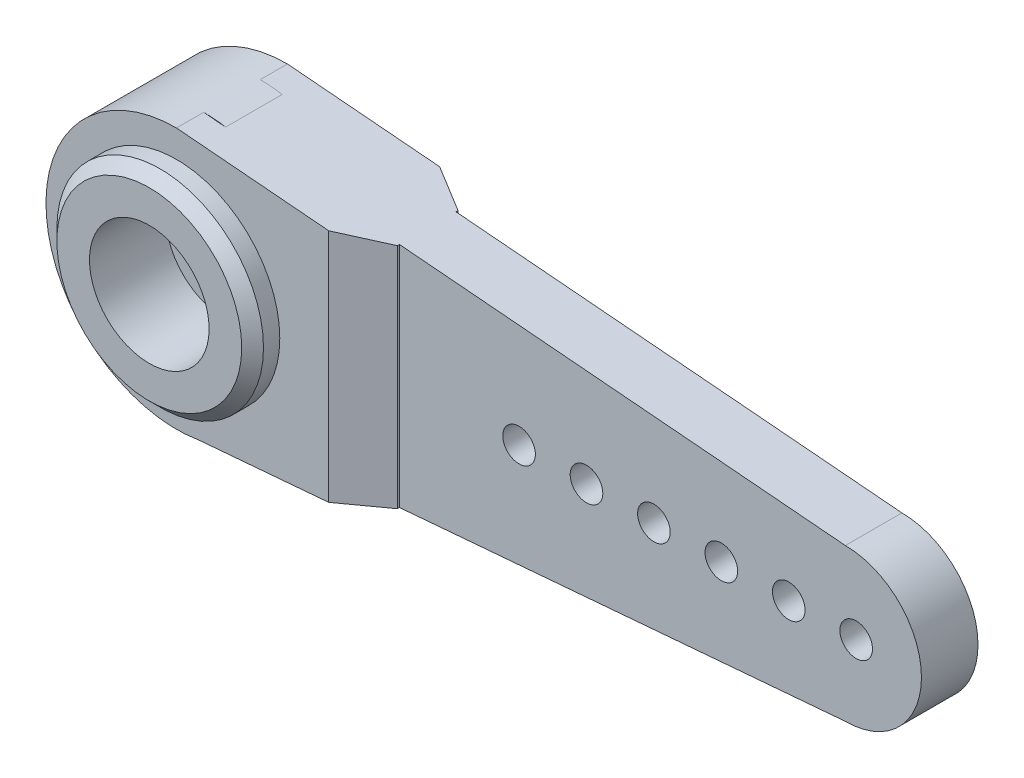
ISO-10303-21;
HEADER;
FILE_DESCRIPTION(('STEP AP214'),'2;1');
FILE_NAME('part.step','',(''),(''),'','','');
FILE_SCHEMA(('AUTOMOTIVE_DESIGN { 1 0 10303 214 1 1 1 1 }'));
ENDSEC;
DATA;
#1=APPLICATION_CONTEXT('core data for automotive mechanical design processes');
#2=APPLICATION_PROTOCOL_DEFINITION('international standard','automotive_design',2000,#1);
#3=PRODUCT_CONTEXT('',#1,'mechanical');
#4=PRODUCT('Part','Part','',(#3));
#5=PRODUCT_RELATED_PRODUCT_CATEGORY('part','',(#4));
#6=PRODUCT_DEFINITION_FORMATION('','',#4);
#7=PRODUCT_DEFINITION_CONTEXT('part definition',#1,'design');
#8=PRODUCT_DEFINITION('design','',#6,#7);
#9=PRODUCT_DEFINITION_SHAPE('','',#8);
#10=(LENGTH_UNIT() NAMED_UNIT(*) SI_UNIT(.MILLI.,.METRE.));
#11=(NAMED_UNIT(*) PLANE_ANGLE_UNIT() SI_UNIT($,.RADIAN.));
#12=(NAMED_UNIT(*) SI_UNIT($,.STERADIAN.) SOLID_ANGLE_UNIT());
#13=UNCERTAINTY_MEASURE_WITH_UNIT(LENGTH_MEASURE(1.E-05),#10,'distance_accuracy_value','');
#14=(GEOMETRIC_REPRESENTATION_CONTEXT(3) GLOBAL_UNCERTAINTY_ASSIGNED_CONTEXT((#13)) GLOBAL_UNIT_ASSIGNED_CONTEXT((#10,
#11,#12)) REPRESENTATION_CONTEXT('',''));
#15=CARTESIAN_POINT('',(0.,0.,0.));
#16=DIRECTION('',(0.,0.,1.));
#17=DIRECTION('',(1.,0.,0.));
#18=AXIS2_PLACEMENT_3D('',#15,#16,#17);
#19=CARTESIAN_POINT('',(9.,0.,-1.25));
#20=DIRECTION('',(1.,0.,0.));
#21=DIRECTION('',(0.,1.,0.));
#22=AXIS2_PLACEMENT_3D('',#19,#20,#21);
#23=PLANE('',#22);
#24=DIRECTION('',(0.,0.,-1.));
#25=VECTOR('',#24,1.);
#26=CARTESIAN_POINT('',(9.,-2.5,-1.25));
#27=LINE('',#26,#25);
#28=CARTESIAN_POINT('',(9.,-2.5,0.));
#29=VERTEX_POINT('',#28);
#30=CARTESIAN_POINT('',(9.,-2.5,-0.0952994616207431));
#31=VERTEX_POINT('',#30);
#32=EDGE_CURVE('E197',#29,#31,#27,.T.);
#33=ORIENTED_EDGE('',*,*,#32,.F.);
#34=DIRECTION('',(0.,1.,0.));
#35=VECTOR('',#34,1.);
#36=CARTESIAN_POINT('',(9.,0.,0.));
#37=LINE('',#36,#35);
#38=CARTESIAN_POINT('',(9.,-5.23728813559322,0.));
#39=VERTEX_POINT('',#38);
#40=EDGE_CURVE('E203',#39,#29,#37,.T.);
#41=ORIENTED_EDGE('',*,*,#40,.F.);
#42=DIRECTION('',(0.,0.,1.));
#43=VECTOR('',#42,1.);
#44=CARTESIAN_POINT('',(9.,-5.23728813559322,-1.25));
#45=LINE('',#44,#43);
#46=CARTESIAN_POINT('',(9.,-5.23728813559322,-0.0952994616207441));
#47=VERTEX_POINT('',#46);
#48=EDGE_CURVE('E221',#47,#39,#45,.T.);
#49=ORIENTED_EDGE('',*,*,#48,.F.);
#50=DIRECTION('',(0.,1.,0.));
#51=VECTOR('',#50,1.);
#52=CARTESIAN_POINT('',(9.,0.,-0.0952994616207441));
#53=LINE('',#52,#51);
#54=EDGE_CURVE('E326',#47,#31,#53,.T.);
#55=ORIENTED_EDGE('',*,*,#54,.T.);
#56=EDGE_LOOP('',(#33,#41,#49,#55));
#57=FACE_BOUND('',#56,.T.);
#58=ADVANCED_FACE('F35',(#57),#23,.T.);
#59=CARTESIAN_POINT('',(9.,0.,-0.0952994616207441));
#60=DIRECTION('',(-0.499999999999999,0.,0.86602540378444));
#61=DIRECTION('',(0.,1.,0.));
#62=AXIS2_PLACEMENT_3D('',#59,#60,#61);
#63=PLANE('',#62);
#64=DIRECTION('',(0.86602540378444,0.,0.499999999999999));
#65=VECTOR('',#64,1.);
#66=CARTESIAN_POINT('',(9.,-2.5,-0.0952994616207439));
#67=LINE('',#66,#65);
#68=CARTESIAN_POINT('',(6.99999999999998,-2.5,-1.25));
#69=VERTEX_POINT('',#68);
#70=EDGE_CURVE('E338',#31,#69,#67,.F.);
#71=ORIENTED_EDGE('',*,*,#70,.F.);
#72=ORIENTED_EDGE('',*,*,#54,.F.);
#73=DIRECTION('',(-0.863702411625004,-0.0731951196292377,-0.498658819851423));
#74=VECTOR('',#73,1.);
#75=CARTESIAN_POINT('',(9.33109507821987,-5.20922923065933,0.0958583709168599));
#76=LINE('',#75,#74);
#77=CARTESIAN_POINT('',(6.99999999999998,-5.40677966101695,-1.25));
#78=VERTEX_POINT('',#77);
#79=EDGE_CURVE('E334',#78,#47,#76,.F.);
#80=ORIENTED_EDGE('',*,*,#79,.F.);
#81=DIRECTION('',(0.,-1.,0.));
#82=VECTOR('',#81,1.);
#83=CARTESIAN_POINT('',(6.99999999999998,0.,-1.25));
#84=LINE('',#83,#82);
#85=EDGE_CURVE('E59',#69,#78,#84,.T.);
#86=ORIENTED_EDGE('',*,*,#85,.F.);
#87=EDGE_LOOP('',(#71,#72,#80,#86));
#88=FACE_BOUND('',#87,.T.);
#89=ADVANCED_FACE('F361',(#88),#63,.F.);
#90=CARTESIAN_POINT('',(0.,0.,0.));
#91=DIRECTION('',(0.,0.,1.));
#92=DIRECTION('',(1.,0.,0.));
#93=AXIS2_PLACEMENT_3D('',#90,#91,#92);
#94=PLANE('',#93);
#95=DIRECTION('',(-0.996428304896931,-0.0844430766861807,0.));
#96=VECTOR('',#95,1.);
#97=CARTESIAN_POINT('',(0.504848830576156,-5.95721620079863,0.));
#98=LINE('',#97,#96);
#99=CARTESIAN_POINT('',(1.00969766115233,-5.91443240159726,0.));
#100=VERTEX_POINT('',#99);
#101=CARTESIAN_POINT('',(0.,-6.,0.));
#102=VERTEX_POINT('',#101);
#103=EDGE_CURVE('E213',#100,#102,#98,.T.);
#104=ORIENTED_EDGE('',*,*,#103,.F.);
#105=CARTESIAN_POINT('',(0.,0.,0.));
#106=DIRECTION('',(0.,0.,1.));
#107=DIRECTION('',(1.,0.,0.));
#108=AXIS2_PLACEMENT_3D('',#105,#106,#107);
#109=CIRCLE('',#108,6.);
#110=EDGE_CURVE('E284',#102,#100,#109,.T.);
#111=ORIENTED_EDGE('',*,*,#110,.F.);
#112=EDGE_LOOP('',(#104,#111));
#113=FACE_BOUND('',#112,.T.);
#114=ADVANCED_FACE('F368',(#113),#94,.F.);
#115=CARTESIAN_POINT('',(1.00969766115229,5.91443240159727,0.));
#116=VERTEX_POINT('',#115);
#117=CARTESIAN_POINT('',(0.,6.,0.));
#118=VERTEX_POINT('',#117);
#119=EDGE_CURVE('E280',#116,#118,#109,.T.);
#120=ORIENTED_EDGE('',*,*,#119,.F.);
#121=DIRECTION('',(-0.996428304896931,0.0844430766861811,0.));
#122=VECTOR('',#121,1.);
#123=CARTESIAN_POINT('',(0.504848830576158,5.95721620079863,0.));
#124=LINE('',#123,#122);
#125=EDGE_CURVE('E209',#116,#118,#124,.T.);
#126=ORIENTED_EDGE('',*,*,#125,.T.);
#127=EDGE_LOOP('',(#120,#126));
#128=FACE_BOUND('',#127,.T.);
#129=ADVANCED_FACE('F420',(#128),#94,.F.);
#130=CARTESIAN_POINT('',(0.,0.,5.1));
#131=DIRECTION('',(0.,0.,-1.));
#132=DIRECTION('',(-1.,0.,0.));
#133=AXIS2_PLACEMENT_3D('',#130,#131,#132);
#134=CYLINDRICAL_SURFACE('',#133,4.75);
#135=CARTESIAN_POINT('',(0.,0.,4.6));
#136=DIRECTION('',(0.,0.,1.));
#137=DIRECTION('',(1.,0.,0.));
#138=AXIS2_PLACEMENT_3D('',#135,#136,#137);
#139=CIRCLE('',#138,4.75);
#140=CARTESIAN_POINT('',(4.75,0.,4.6));
#141=VERTEX_POINT('',#140);
#142=EDGE_CURVE('E11',#141,#141,#139,.F.);
#143=ORIENTED_EDGE('',*,*,#142,.T.);
#144=EDGE_LOOP('',(#143));
#145=FACE_BOUND('',#144,.T.);
#146=CARTESIAN_POINT('',(0.,0.,3.85));
#147=DIRECTION('',(0.,0.,1.));
#148=DIRECTION('',(1.,0.,0.));
#149=AXIS2_PLACEMENT_3D('',#146,#147,#148);
#150=CIRCLE('',#149,4.75);
#151=CARTESIAN_POINT('',(4.75,0.,3.85));
#152=VERTEX_POINT('',#151);
#153=EDGE_CURVE('E236',#152,#152,#150,.F.);
#154=ORIENTED_EDGE('',*,*,#153,.F.);
#155=EDGE_LOOP('',(#154));
#156=FACE_BOUND('',#155,.T.);
#157=ADVANCED_FACE('F478',(#145,#156),#134,.T.);
#158=CARTESIAN_POINT('',(0.,0.,5.1));
#159=DIRECTION('',(0.,0.,1.));
#160=DIRECTION('',(1.,0.,0.));
#161=AXIS2_PLACEMENT_3D('',#158,#159,#160);
#162=PLANE('',#161);
#163=CARTESIAN_POINT('',(0.,0.,5.1));
#164=DIRECTION('',(0.,0.,1.));
#165=DIRECTION('',(1.,0.,0.));
#166=AXIS2_PLACEMENT_3D('',#163,#164,#165);
#167=CIRCLE('',#166,4.25);
#168=CARTESIAN_POINT('',(4.25,0.,5.1));
#169=VERTEX_POINT('',#168);
#170=EDGE_CURVE('E44',#169,#169,#167,.T.);
#171=ORIENTED_EDGE('',*,*,#170,.T.);
#172=EDGE_LOOP('',(#171));
#173=FACE_BOUND('',#172,.T.);
#174=CARTESIAN_POINT('',(0.,0.,5.1));
#175=DIRECTION('',(0.,0.,1.));
#176=DIRECTION('',(1.,0.,0.));
#177=AXIS2_PLACEMENT_3D('',#174,#175,#176);
#178=CIRCLE('',#177,2.75);
#179=CARTESIAN_POINT('',(2.75,0.,5.1));
#180=VERTEX_POINT('',#179);
#181=EDGE_CURVE('E188',#180,#180,#178,.T.);
#182=ORIENTED_EDGE('',*,*,#181,.F.);
#183=EDGE_LOOP('',(#182));
#184=FACE_BOUND('',#183,.T.);
#185=ADVANCED_FACE('F343',(#173,#184),#162,.T.);
#186=CARTESIAN_POINT('',(9.,0.,3.85));
#187=DIRECTION('',(1.,0.,0.));
#188=DIRECTION('',(0.,0.,-1.));
#189=AXIS2_PLACEMENT_3D('',#186,#187,#188);
#190=PLANE('',#189);
#191=DIRECTION('',(0.,0.,-1.));
#192=VECTOR('',#191,1.);
#193=CARTESIAN_POINT('',(9.,5.23728813559322,3.85));
#194=LINE('',#193,#192);
#195=CARTESIAN_POINT('',(9.,5.23728813559322,2.69529946162074));
#196=VERTEX_POINT('',#195);
#197=CARTESIAN_POINT('',(9.,5.23728813559322,2.6));
#198=VERTEX_POINT('',#197);
#199=EDGE_CURVE('E248',#196,#198,#194,.T.);
#200=ORIENTED_EDGE('',*,*,#199,.F.);
#201=DIRECTION('',(0.,-1.,0.));
#202=VECTOR('',#201,1.);
#203=CARTESIAN_POINT('',(9.,0.,2.69529946162074));
#204=LINE('',#203,#202);
#205=CARTESIAN_POINT('',(9.,-5.23728813559322,2.69529946162074));
#206=VERTEX_POINT('',#205);
#207=EDGE_CURVE('E301',#196,#206,#204,.T.);
#208=ORIENTED_EDGE('',*,*,#207,.T.);
#209=DIRECTION('',(0.,0.,-1.));
#210=VECTOR('',#209,1.);
#211=CARTESIAN_POINT('',(9.,-5.23728813559322,3.85));
#212=LINE('',#211,#210);
#213=CARTESIAN_POINT('',(9.,-5.23728813559322,2.6));
#214=VERTEX_POINT('',#213);
#215=EDGE_CURVE('E239',#206,#214,#212,.T.);
#216=ORIENTED_EDGE('',*,*,#215,.T.);
#217=DIRECTION('',(0.,-1.,0.));
#218=VECTOR('',#217,1.);
#219=CARTESIAN_POINT('',(9.,0.,2.6));
#220=LINE('',#219,#218);
#221=EDGE_CURVE('E226',#198,#214,#220,.T.);
#222=ORIENTED_EDGE('',*,*,#221,.F.);
#223=EDGE_LOOP('',(#200,#208,#216,#222));
#224=FACE_BOUND('',#223,.T.);
#225=ADVANCED_FACE('F437',(#224),#190,.T.);
#226=CARTESIAN_POINT('',(0.,0.,3.85));
#227=DIRECTION('',(0.,0.,1.));
#228=DIRECTION('',(1.,0.,0.));
#229=AXIS2_PLACEMENT_3D('',#226,#227,#228);
#230=PLANE('',#229);
#231=DIRECTION('',(0.996428304896931,0.0844430766861807,0.));
#232=VECTOR('',#231,1.);
#233=CARTESIAN_POINT('',(0.504848830576156,-5.95721620079863,3.85));
#234=LINE('',#233,#232);
#235=CARTESIAN_POINT('',(1.00969766115233,-5.91443240159726,3.85));
#236=VERTEX_POINT('',#235);
#237=CARTESIAN_POINT('',(6.99999999999998,-5.40677966101695,3.85));
#238=VERTEX_POINT('',#237);
#239=EDGE_CURVE('E233',#236,#238,#234,.T.);
#240=ORIENTED_EDGE('',*,*,#239,.T.);
#241=DIRECTION('',(0.,1.,0.));
#242=VECTOR('',#241,1.);
#243=CARTESIAN_POINT('',(6.99999999999998,0.,3.85));
#244=LINE('',#243,#242);
#245=CARTESIAN_POINT('',(6.99999999999998,5.40677966101695,3.85));
#246=VERTEX_POINT('',#245);
#247=EDGE_CURVE('E323',#238,#246,#244,.T.);
#248=ORIENTED_EDGE('',*,*,#247,.T.);
#249=DIRECTION('',(-0.996428304896931,0.0844430766861807,0.));
#250=VECTOR('',#249,1.);
#251=CARTESIAN_POINT('',(0.504848830576156,5.95721620079863,3.85));
#252=LINE('',#251,#250);
#253=CARTESIAN_POINT('',(0.,6.,3.85));
#254=VERTEX_POINT('',#253);
#255=EDGE_CURVE('E227',#246,#254,#252,.T.);
#256=ORIENTED_EDGE('',*,*,#255,.T.);
#257=CARTESIAN_POINT('',(0.,0.,3.85));
#258=DIRECTION('',(0.,0.,1.));
#259=DIRECTION('',(1.,0.,0.));
#260=AXIS2_PLACEMENT_3D('',#257,#258,#259);
#261=CIRCLE('',#260,6.);
#262=EDGE_CURVE('E229',#254,#236,#261,.T.);
#263=ORIENTED_EDGE('',*,*,#262,.T.);
#264=EDGE_LOOP('',(#240,#248,#256,#263));
#265=FACE_BOUND('',#264,.T.);
#266=ORIENTED_EDGE('',*,*,#153,.T.);
#267=EDGE_LOOP('',(#266));
#268=FACE_BOUND('',#267,.T.);
#269=ADVANCED_FACE('F430',(#265,#268),#230,.T.);
#270=CARTESIAN_POINT('',(14.5,-1.08603315543881E-13,-1.4));
#271=DIRECTION('',(0.,0.,1.));
#272=DIRECTION('',(1.,0.,0.));
#273=AXIS2_PLACEMENT_3D('',#270,#271,#272);
#274=CYLINDRICAL_SURFACE('',#273,0.75);
#275=CARTESIAN_POINT('',(14.5,-1.08603315543881E-13,2.6));
#276=DIRECTION('',(0.,0.,1.));
#277=DIRECTION('',(1.,0.,0.));
#278=AXIS2_PLACEMENT_3D('',#275,#276,#277);
#279=CIRCLE('',#278,0.75);
#280=CARTESIAN_POINT('',(15.25,-1.08603315543881E-13,2.6));
#281=VERTEX_POINT('',#280);
#282=EDGE_CURVE('E250',#281,#281,#279,.T.);
#283=ORIENTED_EDGE('',*,*,#282,.T.);
#284=EDGE_LOOP('',(#283));
#285=FACE_BOUND('',#284,.T.);
#286=CARTESIAN_POINT('',(14.5,-1.08603315543881E-13,0.));
#287=DIRECTION('',(0.,0.,1.));
#288=DIRECTION('',(1.,0.,0.));
#289=AXIS2_PLACEMENT_3D('',#286,#287,#288);
#290=CIRCLE('',#289,0.75);
#291=CARTESIAN_POINT('',(15.25,-1.08603315543881E-13,0.));
#292=VERTEX_POINT('',#291);
#293=EDGE_CURVE('E254',#292,#292,#290,.T.);
#294=ORIENTED_EDGE('',*,*,#293,.F.);
#295=EDGE_LOOP('',(#294));
#296=FACE_BOUND('',#295,.T.);
#297=ADVANCED_FACE('F456',(#285,#296),#274,.F.);
#298=CARTESIAN_POINT('',(17.6,0.,-1.4));
#299=DIRECTION('',(0.,0.,1.));
#300=DIRECTION('',(1.,0.,0.));
#301=AXIS2_PLACEMENT_3D('',#298,#299,#300);
#302=CYLINDRICAL_SURFACE('',#301,0.750000000000002);
#303=CARTESIAN_POINT('',(17.6,0.,2.6));
#304=DIRECTION('',(0.,0.,1.));
#305=DIRECTION('',(1.,0.,0.));
#306=AXIS2_PLACEMENT_3D('',#303,#304,#305);
#307=CIRCLE('',#306,0.750000000000002);
#308=CARTESIAN_POINT('',(18.35,0.,2.6));
#309=VERTEX_POINT('',#308);
#310=EDGE_CURVE('E264',#309,#309,#307,.T.);
#311=ORIENTED_EDGE('',*,*,#310,.T.);
#312=EDGE_LOOP('',(#311));
#313=FACE_BOUND('',#312,.T.);
#314=CARTESIAN_POINT('',(17.6,0.,0.));
#315=DIRECTION('',(0.,0.,1.));
#316=DIRECTION('',(1.,0.,0.));
#317=AXIS2_PLACEMENT_3D('',#314,#315,#316);
#318=CIRCLE('',#317,0.750000000000002);
#319=CARTESIAN_POINT('',(18.35,0.,0.));
#320=VERTEX_POINT('',#319);
#321=EDGE_CURVE('E304',#320,#320,#318,.T.);
#322=ORIENTED_EDGE('',*,*,#321,.F.);
#323=EDGE_LOOP('',(#322));
#324=FACE_BOUND('',#323,.T.);
#325=ADVANCED_FACE('F459',(#313,#324),#302,.F.);
#326=CARTESIAN_POINT('',(20.7,0.,-1.4));
#327=DIRECTION('',(0.,0.,1.));
#328=DIRECTION('',(1.,0.,0.));
#329=AXIS2_PLACEMENT_3D('',#326,#327,#328);
#330=CYLINDRICAL_SURFACE('',#329,0.750000000000002);
#331=CARTESIAN_POINT('',(20.7,0.,2.6));
#332=DIRECTION('',(0.,0.,1.));
#333=DIRECTION('',(1.,0.,0.));
#334=AXIS2_PLACEMENT_3D('',#331,#332,#333);
#335=CIRCLE('',#334,0.750000000000002);
#336=CARTESIAN_POINT('',(21.45,0.,2.6));
#337=VERTEX_POINT('',#336);
#338=EDGE_CURVE('E261',#337,#337,#335,.T.);
#339=ORIENTED_EDGE('',*,*,#338,.T.);
#340=EDGE_LOOP('',(#339));
#341=FACE_BOUND('',#340,.T.);
#342=CARTESIAN_POINT('',(20.7,0.,0.));
#343=DIRECTION('',(0.,0.,1.));
#344=DIRECTION('',(1.,0.,0.));
#345=AXIS2_PLACEMENT_3D('',#342,#343,#344);
#346=CIRCLE('',#345,0.750000000000002);
#347=CARTESIAN_POINT('',(21.45,0.,0.));
#348=VERTEX_POINT('',#347);
#349=EDGE_CURVE('E307',#348,#348,#346,.T.);
#350=ORIENTED_EDGE('',*,*,#349,.F.);
#351=EDGE_LOOP('',(#350));
#352=FACE_BOUND('',#351,.T.);
#353=ADVANCED_FACE('F492',(#341,#352),#330,.F.);
#354=CARTESIAN_POINT('',(23.8,0.,-1.4));
#355=DIRECTION('',(0.,0.,1.));
#356=DIRECTION('',(1.,0.,0.));
#357=AXIS2_PLACEMENT_3D('',#354,#355,#356);
#358=CYLINDRICAL_SURFACE('',#357,0.750000000000002);
#359=CARTESIAN_POINT('',(23.8,0.,2.6));
#360=DIRECTION('',(0.,0.,1.));
#361=DIRECTION('',(1.,0.,0.));
#362=AXIS2_PLACEMENT_3D('',#359,#360,#361);
#363=CIRCLE('',#362,0.750000000000002);
#364=CARTESIAN_POINT('',(24.55,0.,2.6));
#365=VERTEX_POINT('',#364);
#366=EDGE_CURVE('E258',#365,#365,#363,.T.);
#367=ORIENTED_EDGE('',*,*,#366,.T.);
#368=EDGE_LOOP('',(#367));
#369=FACE_BOUND('',#368,.T.);
#370=CARTESIAN_POINT('',(23.8,0.,0.));
#371=DIRECTION('',(0.,0.,1.));
#372=DIRECTION('',(1.,0.,0.));
#373=AXIS2_PLACEMENT_3D('',#370,#371,#372);
#374=CIRCLE('',#373,0.750000000000002);
#375=CARTESIAN_POINT('',(24.55,0.,0.));
#376=VERTEX_POINT('',#375);
#377=EDGE_CURVE('E310',#376,#376,#374,.T.);
#378=ORIENTED_EDGE('',*,*,#377,.F.);
#379=EDGE_LOOP('',(#378));
#380=FACE_BOUND('',#379,.T.);
#381=ADVANCED_FACE('F496',(#369,#380),#358,.F.);
#382=CARTESIAN_POINT('',(26.9,0.,-1.4));
#383=DIRECTION('',(0.,0.,1.));
#384=DIRECTION('',(1.,0.,0.));
#385=AXIS2_PLACEMENT_3D('',#382,#383,#384);
#386=CYLINDRICAL_SURFACE('',#385,0.750000000000002);
#387=CARTESIAN_POINT('',(26.9,0.,2.6));
#388=DIRECTION('',(0.,0.,1.));
#389=DIRECTION('',(1.,0.,0.));
#390=AXIS2_PLACEMENT_3D('',#387,#388,#389);
#391=CIRCLE('',#390,0.750000000000002);
#392=CARTESIAN_POINT('',(27.65,0.,2.6));
#393=VERTEX_POINT('',#392);
#394=EDGE_CURVE('E255',#393,#393,#391,.T.);
#395=ORIENTED_EDGE('',*,*,#394,.T.);
#396=EDGE_LOOP('',(#395));
#397=FACE_BOUND('',#396,.T.);
#398=CARTESIAN_POINT('',(26.9,0.,0.));
#399=DIRECTION('',(0.,0.,1.));
#400=DIRECTION('',(1.,0.,0.));
#401=AXIS2_PLACEMENT_3D('',#398,#399,#400);
#402=CIRCLE('',#401,0.750000000000002);
#403=CARTESIAN_POINT('',(27.65,0.,0.));
#404=VERTEX_POINT('',#403);
#405=EDGE_CURVE('E313',#404,#404,#402,.T.);
#406=ORIENTED_EDGE('',*,*,#405,.F.);
#407=EDGE_LOOP('',(#406));
#408=FACE_BOUND('',#407,.T.);
#409=ADVANCED_FACE('F500',(#397,#408),#386,.F.);
#410=CARTESIAN_POINT('',(30.,0.,-1.4));
#411=DIRECTION('',(0.,0.,1.));
#412=DIRECTION('',(1.,0.,0.));
#413=AXIS2_PLACEMENT_3D('',#410,#411,#412);
#414=CYLINDRICAL_SURFACE('',#413,0.750000000000002);
#415=CARTESIAN_POINT('',(30.,0.,2.6));
#416=DIRECTION('',(0.,0.,1.));
#417=DIRECTION('',(1.,0.,0.));
#418=AXIS2_PLACEMENT_3D('',#415,#416,#417);
#419=CIRCLE('',#418,0.750000000000002);
#420=CARTESIAN_POINT('',(30.75,0.,2.6));
#421=VERTEX_POINT('',#420);
#422=EDGE_CURVE('E251',#421,#421,#419,.T.);
#423=ORIENTED_EDGE('',*,*,#422,.T.);
#424=EDGE_LOOP('',(#423));
#425=FACE_BOUND('',#424,.T.);
#426=CARTESIAN_POINT('',(30.,0.,0.));
#427=DIRECTION('',(0.,0.,1.));
#428=DIRECTION('',(1.,0.,0.));
#429=AXIS2_PLACEMENT_3D('',#426,#427,#428);
#430=CIRCLE('',#429,0.750000000000002);
#431=CARTESIAN_POINT('',(30.75,0.,0.));
#432=VERTEX_POINT('',#431);
#433=EDGE_CURVE('E316',#432,#432,#430,.T.);
#434=ORIENTED_EDGE('',*,*,#433,.F.);
#435=EDGE_LOOP('',(#434));
#436=FACE_BOUND('',#435,.T.);
#437=ADVANCED_FACE('F471',(#425,#436),#414,.F.);
#438=CARTESIAN_POINT('',(29.5,0.,2.6));
#439=DIRECTION('',(0.,0.,-1.));
#440=DIRECTION('',(-1.,0.,0.));
#441=AXIS2_PLACEMENT_3D('',#438,#439,#440);
#442=CYLINDRICAL_SURFACE('',#441,3.5);
#443=CARTESIAN_POINT('',(29.5,0.,0.));
#444=DIRECTION('',(0.,0.,1.));
#445=DIRECTION('',(1.,0.,0.));
#446=AXIS2_PLACEMENT_3D('',#443,#444,#445);
#447=CIRCLE('',#446,3.5);
#448=CARTESIAN_POINT('',(29.5,-3.5,0.));
#449=VERTEX_POINT('',#448);
#450=CARTESIAN_POINT('',(29.5,3.5,0.));
#451=VERTEX_POINT('',#450);
#452=EDGE_CURVE('E286',#449,#451,#447,.T.);
#453=ORIENTED_EDGE('',*,*,#452,.T.);
#454=DIRECTION('',(0.,0.,-1.));
#455=VECTOR('',#454,1.);
#456=CARTESIAN_POINT('',(29.5,3.5,2.6));
#457=LINE('',#456,#455);
#458=CARTESIAN_POINT('',(29.5,3.5,2.6));
#459=VERTEX_POINT('',#458);
#460=EDGE_CURVE('E292',#459,#451,#457,.T.);
#461=ORIENTED_EDGE('',*,*,#460,.F.);
#462=CARTESIAN_POINT('',(29.5,0.,2.6));
#463=DIRECTION('',(0.,0.,1.));
#464=DIRECTION('',(1.,0.,0.));
#465=AXIS2_PLACEMENT_3D('',#462,#463,#464);
#466=CIRCLE('',#465,3.5);
#467=CARTESIAN_POINT('',(29.5,-3.5,2.6));
#468=VERTEX_POINT('',#467);
#469=EDGE_CURVE('E274',#468,#459,#466,.T.);
#470=ORIENTED_EDGE('',*,*,#469,.F.);
#471=DIRECTION('',(0.,0.,-1.));
#472=VECTOR('',#471,1.);
#473=CARTESIAN_POINT('',(29.5,-3.5,2.6));
#474=LINE('',#473,#472);
#475=EDGE_CURVE('E295',#468,#449,#474,.T.);
#476=ORIENTED_EDGE('',*,*,#475,.T.);
#477=EDGE_LOOP('',(#453,#461,#470,#476));
#478=FACE_BOUND('',#477,.T.);
#479=ADVANCED_FACE('F400',(#478),#442,.T.);
#480=ORIENTED_EDGE('',*,*,#433,.T.);
#481=EDGE_LOOP('',(#480));
#482=FACE_BOUND('',#481,.T.);
#483=ORIENTED_EDGE('',*,*,#405,.T.);
#484=EDGE_LOOP('',(#483));
#485=FACE_BOUND('',#484,.T.);
#486=ORIENTED_EDGE('',*,*,#377,.T.);
#487=EDGE_LOOP('',(#486));
#488=FACE_BOUND('',#487,.T.);
#489=ORIENTED_EDGE('',*,*,#349,.T.);
#490=EDGE_LOOP('',(#489));
#491=FACE_BOUND('',#490,.T.);
#492=ORIENTED_EDGE('',*,*,#321,.T.);
#493=EDGE_LOOP('',(#492));
#494=FACE_BOUND('',#493,.T.);
#495=ORIENTED_EDGE('',*,*,#293,.T.);
#496=EDGE_LOOP('',(#495));
#497=FACE_BOUND('',#496,.T.);
#498=ORIENTED_EDGE('',*,*,#40,.T.);
#499=DIRECTION('',(-1.,0.,0.));
#500=VECTOR('',#499,1.);
#501=CARTESIAN_POINT('',(6.46446213793176,-2.5,0.));
#502=LINE('',#501,#500);
#503=CARTESIAN_POINT('',(6.46446213793176,-2.5,0.));
#504=VERTEX_POINT('',#503);
#505=EDGE_CURVE('E171',#29,#504,#502,.T.);
#506=ORIENTED_EDGE('',*,*,#505,.T.);
#507=DIRECTION('',(0.,1.,0.));
#508=VECTOR('',#507,1.);
#509=CARTESIAN_POINT('',(6.46446213793176,-2.5,0.));
#510=LINE('',#509,#508);
#511=CARTESIAN_POINT('',(6.46446213793176,2.5,0.));
#512=VERTEX_POINT('',#511);
#513=EDGE_CURVE('E167',#504,#512,#510,.T.);
#514=ORIENTED_EDGE('',*,*,#513,.T.);
#515=DIRECTION('',(1.,0.,0.));
#516=VECTOR('',#515,1.);
#517=CARTESIAN_POINT('',(6.46446213793176,2.5,0.));
#518=LINE('',#517,#516);
#519=CARTESIAN_POINT('',(9.,2.5,0.));
#520=VERTEX_POINT('',#519);
#521=EDGE_CURVE('E174',#512,#520,#518,.T.);
#522=ORIENTED_EDGE('',*,*,#521,.T.);
#523=CARTESIAN_POINT('',(9.,5.23728813559322,0.));
#524=VERTEX_POINT('',#523);
#525=EDGE_CURVE('E199',#520,#524,#37,.T.);
#526=ORIENTED_EDGE('',*,*,#525,.T.);
#527=DIRECTION('',(-0.996428304896931,0.0844430766861807,0.));
#528=VECTOR('',#527,1.);
#529=CARTESIAN_POINT('',(1.00969766115232,5.91443240159726,0.));
#530=LINE('',#529,#528);
#531=EDGE_CURVE('E272',#451,#524,#530,.T.);
#532=ORIENTED_EDGE('',*,*,#531,.F.);
#533=ORIENTED_EDGE('',*,*,#452,.F.);
#534=DIRECTION('',(0.996428304896931,0.0844430766861807,0.));
#535=VECTOR('',#534,1.);
#536=CARTESIAN_POINT('',(29.5,-3.5,0.));
#537=LINE('',#536,#535);
#538=EDGE_CURVE('E283',#39,#449,#537,.T.);
#539=ORIENTED_EDGE('',*,*,#538,.F.);
#540=EDGE_LOOP('',(#498,#506,#514,#522,#526,#532,#533,#539));
#541=FACE_BOUND('',#540,.T.);
#542=ADVANCED_FACE('F182',(#482,#485,#488,#491,#494,#497,#541),#94,.F.);
#543=CARTESIAN_POINT('',(29.5,-3.5,2.6));
#544=DIRECTION('',(-0.0844430766861807,0.996428304896931,0.));
#545=DIRECTION('',(-0.996428304896931,-0.0844430766861807,0.));
#546=AXIS2_PLACEMENT_3D('',#543,#544,#545);
#547=PLANE('',#546);
#548=DIRECTION('',(-0.996428304896931,-0.0844430766861807,0.));
#549=VECTOR('',#548,1.);
#550=CARTESIAN_POINT('',(0.504848830576156,-5.95721620079863,-1.25));
#551=LINE('',#550,#549);
#552=CARTESIAN_POINT('',(0.,-6.,-1.25));
#553=VERTEX_POINT('',#552);
#554=EDGE_CURVE('E202',#78,#553,#551,.T.);
#555=ORIENTED_EDGE('',*,*,#554,.F.);
#556=ORIENTED_EDGE('',*,*,#79,.T.);
#557=ORIENTED_EDGE('',*,*,#48,.T.);
#558=ORIENTED_EDGE('',*,*,#538,.T.);
#559=ORIENTED_EDGE('',*,*,#475,.F.);
#560=DIRECTION('',(0.996428304896931,0.0844430766861807,0.));
#561=VECTOR('',#560,1.);
#562=CARTESIAN_POINT('',(29.5,-3.5,2.6));
#563=LINE('',#562,#561);
#564=EDGE_CURVE('E271',#214,#468,#563,.T.);
#565=ORIENTED_EDGE('',*,*,#564,.F.);
#566=ORIENTED_EDGE('',*,*,#215,.F.);
#567=DIRECTION('',(0.863702411625004,0.0731951196292377,-0.498658819851423));
#568=VECTOR('',#567,1.);
#569=CARTESIAN_POINT('',(9.33109507821987,-5.20922923065933,2.50414162908314));
#570=LINE('',#569,#568);
#571=EDGE_CURVE('E321',#206,#238,#570,.F.);
#572=ORIENTED_EDGE('',*,*,#571,.T.);
#573=ORIENTED_EDGE('',*,*,#239,.F.);
#574=DIRECTION('',(0.,0.,-1.));
#575=VECTOR('',#574,1.);
#576=CARTESIAN_POINT('',(1.00969766115232,-5.91443240159726,2.6));
#577=LINE('',#576,#575);
#578=EDGE_CURVE('E298',#236,#100,#577,.T.);
#579=ORIENTED_EDGE('',*,*,#578,.T.);
#580=ORIENTED_EDGE('',*,*,#103,.T.);
#581=DIRECTION('',(0.,0.,1.));
#582=VECTOR('',#581,1.);
#583=CARTESIAN_POINT('',(0.,-6.,-1.25));
#584=LINE('',#583,#582);
#585=EDGE_CURVE('E218',#553,#102,#584,.T.);
#586=ORIENTED_EDGE('',*,*,#585,.F.);
#587=EDGE_LOOP('',(#555,#556,#557,#558,#559,#565,#566,#572,#573,#579,#580,#586));
#588=FACE_BOUND('',#587,.T.);
#589=ADVANCED_FACE('F405',(#588),#547,.F.);
#590=CARTESIAN_POINT('',(0.,0.,2.6));
#591=DIRECTION('',(0.,0.,-1.));
#592=DIRECTION('',(-1.,0.,0.));
#593=AXIS2_PLACEMENT_3D('',#590,#591,#592);
#594=CYLINDRICAL_SURFACE('',#593,6.);
#595=ORIENTED_EDGE('',*,*,#119,.T.);
#596=DIRECTION('',(0.,0.,1.));
#597=VECTOR('',#596,1.);
#598=CARTESIAN_POINT('',(0.,6.,-1.25));
#599=LINE('',#598,#597);
#600=CARTESIAN_POINT('',(0.,6.,-1.25));
#601=VERTEX_POINT('',#600);
#602=EDGE_CURVE('E208',#601,#118,#599,.T.);
#603=ORIENTED_EDGE('',*,*,#602,.F.);
#604=CARTESIAN_POINT('',(0.,0.,-1.25));
#605=DIRECTION('',(0.,0.,-1.));
#606=DIRECTION('',(-1.,0.,0.));
#607=AXIS2_PLACEMENT_3D('',#604,#605,#606);
#608=CIRCLE('',#607,6.);
#609=EDGE_CURVE('E205',#553,#601,#608,.T.);
#610=ORIENTED_EDGE('',*,*,#609,.F.);
#611=ORIENTED_EDGE('',*,*,#585,.T.);
#612=ORIENTED_EDGE('',*,*,#110,.T.);
#613=ORIENTED_EDGE('',*,*,#578,.F.);
#614=ORIENTED_EDGE('',*,*,#262,.F.);
#615=DIRECTION('',(0.,0.,-1.));
#616=VECTOR('',#615,1.);
#617=CARTESIAN_POINT('',(0.,6.,3.85));
#618=LINE('',#617,#616);
#619=CARTESIAN_POINT('',(0.,6.,2.6));
#620=VERTEX_POINT('',#619);
#621=EDGE_CURVE('E245',#254,#620,#618,.T.);
#622=ORIENTED_EDGE('',*,*,#621,.T.);
#623=CARTESIAN_POINT('',(0.,0.,2.6));
#624=DIRECTION('',(0.,0.,1.));
#625=DIRECTION('',(1.,0.,0.));
#626=AXIS2_PLACEMENT_3D('',#623,#624,#625);
#627=CIRCLE('',#626,6.);
#628=CARTESIAN_POINT('',(1.00969766115232,5.91443240159726,2.6));
#629=VERTEX_POINT('',#628);
#630=EDGE_CURVE('E269',#629,#620,#627,.T.);
#631=ORIENTED_EDGE('',*,*,#630,.F.);
#632=DIRECTION('',(0.,0.,-1.));
#633=VECTOR('',#632,1.);
#634=CARTESIAN_POINT('',(1.00969766115232,5.91443240159726,2.6));
#635=LINE('',#634,#633);
#636=EDGE_CURVE('E279',#629,#116,#635,.T.);
#637=ORIENTED_EDGE('',*,*,#636,.T.);
#638=EDGE_LOOP('',(#595,#603,#610,#611,#612,#613,#614,#622,#631,#637));
#639=FACE_BOUND('',#638,.T.);
#640=ADVANCED_FACE('F421',(#639),#594,.T.);
#641=CARTESIAN_POINT('',(1.00969766115232,5.91443240159726,2.6));
#642=DIRECTION('',(-0.0844430766861807,-0.996428304896931,0.));
#643=DIRECTION('',(0.996428304896931,-0.0844430766861807,0.));
#644=AXIS2_PLACEMENT_3D('',#641,#642,#643);
#645=PLANE('',#644);
#646=DIRECTION('',(0.,0.,1.));
#647=VECTOR('',#646,1.);
#648=CARTESIAN_POINT('',(9.,5.23728813559322,-1.25));
#649=LINE('',#648,#647);
#650=CARTESIAN_POINT('',(9.,5.23728813559322,-0.0952994616207441));
#651=VERTEX_POINT('',#650);
#652=EDGE_CURVE('E223',#651,#524,#649,.T.);
#653=ORIENTED_EDGE('',*,*,#652,.F.);
#654=DIRECTION('',(0.863702411625004,-0.0731951196292377,0.498658819851423));
#655=VECTOR('',#654,1.);
#656=CARTESIAN_POINT('',(9.33109507821987,5.20922923065933,0.0958583709168593));
#657=LINE('',#656,#655);
#658=CARTESIAN_POINT('',(6.99999999999998,5.40677966101695,-1.25));
#659=VERTEX_POINT('',#658);
#660=EDGE_CURVE('E329',#651,#659,#657,.F.);
#661=ORIENTED_EDGE('',*,*,#660,.T.);
#662=DIRECTION('',(-0.996428304896931,0.0844430766861811,0.));
#663=VECTOR('',#662,1.);
#664=CARTESIAN_POINT('',(0.504848830576158,5.95721620079863,-1.25));
#665=LINE('',#664,#663);
#666=EDGE_CURVE('E200',#659,#601,#665,.T.);
#667=ORIENTED_EDGE('',*,*,#666,.T.);
#668=ORIENTED_EDGE('',*,*,#602,.T.);
#669=ORIENTED_EDGE('',*,*,#125,.F.);
#670=ORIENTED_EDGE('',*,*,#636,.F.);
#671=DIRECTION('',(-0.996428304896931,0.0844430766861807,0.));
#672=VECTOR('',#671,1.);
#673=CARTESIAN_POINT('',(0.504848830576156,5.95721620079863,2.6));
#674=LINE('',#673,#672);
#675=EDGE_CURVE('E230',#629,#620,#674,.T.);
#676=ORIENTED_EDGE('',*,*,#675,.T.);
#677=ORIENTED_EDGE('',*,*,#621,.F.);
#678=ORIENTED_EDGE('',*,*,#255,.F.);
#679=DIRECTION('',(-0.863702411625004,0.0731951196292377,0.498658819851423));
#680=VECTOR('',#679,1.);
#681=CARTESIAN_POINT('',(9.33109507821987,5.20922923065933,2.50414162908314));
#682=LINE('',#681,#680);
#683=EDGE_CURVE('E216',#246,#196,#682,.F.);
#684=ORIENTED_EDGE('',*,*,#683,.T.);
#685=ORIENTED_EDGE('',*,*,#199,.T.);
#686=DIRECTION('',(-0.996428304896931,0.0844430766861807,0.));
#687=VECTOR('',#686,1.);
#688=CARTESIAN_POINT('',(1.00969766115232,5.91443240159726,2.6));
#689=LINE('',#688,#687);
#690=EDGE_CURVE('E276',#459,#198,#689,.T.);
#691=ORIENTED_EDGE('',*,*,#690,.F.);
#692=ORIENTED_EDGE('',*,*,#460,.T.);
#693=ORIENTED_EDGE('',*,*,#531,.T.);
#694=EDGE_LOOP('',(#653,#661,#667,#668,#669,#670,#676,#677,#678,#684,#685,#691,#692,#693));
#695=FACE_BOUND('',#694,.T.);
#696=ADVANCED_FACE('F393',(#695),#645,.F.);
#697=CARTESIAN_POINT('',(0.,0.,2.6));
#698=DIRECTION('',(0.,0.,1.));
#699=DIRECTION('',(1.,0.,0.));
#700=AXIS2_PLACEMENT_3D('',#697,#698,#699);
#701=PLANE('',#700);
#702=ORIENTED_EDGE('',*,*,#630,.T.);
#703=ORIENTED_EDGE('',*,*,#675,.F.);
#704=EDGE_LOOP('',(#702,#703));
#705=FACE_BOUND('',#704,.T.);
#706=ADVANCED_FACE('F442',(#705),#701,.T.);
#707=ORIENTED_EDGE('',*,*,#221,.T.);
#708=ORIENTED_EDGE('',*,*,#564,.T.);
#709=ORIENTED_EDGE('',*,*,#469,.T.);
#710=ORIENTED_EDGE('',*,*,#690,.T.);
#711=EDGE_LOOP('',(#707,#708,#709,#710));
#712=FACE_BOUND('',#711,.T.);
#713=ORIENTED_EDGE('',*,*,#422,.F.);
#714=EDGE_LOOP('',(#713));
#715=FACE_BOUND('',#714,.T.);
#716=ORIENTED_EDGE('',*,*,#394,.F.);
#717=EDGE_LOOP('',(#716));
#718=FACE_BOUND('',#717,.T.);
#719=ORIENTED_EDGE('',*,*,#366,.F.);
#720=EDGE_LOOP('',(#719));
#721=FACE_BOUND('',#720,.T.);
#722=ORIENTED_EDGE('',*,*,#338,.F.);
#723=EDGE_LOOP('',(#722));
#724=FACE_BOUND('',#723,.T.);
#725=ORIENTED_EDGE('',*,*,#310,.F.);
#726=EDGE_LOOP('',(#725));
#727=FACE_BOUND('',#726,.T.);
#728=ORIENTED_EDGE('',*,*,#282,.F.);
#729=EDGE_LOOP('',(#728));
#730=FACE_BOUND('',#729,.T.);
#731=ADVANCED_FACE('F383',(#712,#715,#718,#721,#724,#727,#730),#701,.T.);
#732=CARTESIAN_POINT('',(9.,0.,2.69529946162074));
#733=DIRECTION('',(-0.499999999999999,0.,-0.86602540378444));
#734=DIRECTION('',(0.,-1.,0.));
#735=AXIS2_PLACEMENT_3D('',#732,#733,#734);
#736=PLANE('',#735);
#737=ORIENTED_EDGE('',*,*,#683,.F.);
#738=ORIENTED_EDGE('',*,*,#247,.F.);
#739=ORIENTED_EDGE('',*,*,#571,.F.);
#740=ORIENTED_EDGE('',*,*,#207,.F.);
#741=EDGE_LOOP('',(#737,#738,#739,#740));
#742=FACE_BOUND('',#741,.T.);
#743=ADVANCED_FACE('F376',(#742),#736,.F.);
#744=DIRECTION('',(0.,0.,1.));
#745=VECTOR('',#744,1.);
#746=CARTESIAN_POINT('',(9.,2.5,-1.25));
#747=LINE('',#746,#745);
#748=CARTESIAN_POINT('',(9.,2.5,-0.0952994616207434));
#749=VERTEX_POINT('',#748);
#750=EDGE_CURVE('E177',#749,#520,#747,.T.);
#751=ORIENTED_EDGE('',*,*,#750,.F.);
#752=EDGE_CURVE('E212',#749,#651,#53,.T.);
#753=ORIENTED_EDGE('',*,*,#752,.T.);
#754=ORIENTED_EDGE('',*,*,#652,.T.);
#755=ORIENTED_EDGE('',*,*,#525,.F.);
#756=EDGE_LOOP('',(#751,#753,#754,#755));
#757=FACE_BOUND('',#756,.T.);
#758=ADVANCED_FACE('F364',(#757),#23,.T.);
#759=CARTESIAN_POINT('',(0.,0.,-1.25));
#760=DIRECTION('',(0.,0.,-1.));
#761=DIRECTION('',(-1.,0.,0.));
#762=AXIS2_PLACEMENT_3D('',#759,#760,#761);
#763=PLANE('',#762);
#764=CARTESIAN_POINT('',(0.,0.,-1.25));
#765=DIRECTION('',(0.,0.,-1.));
#766=DIRECTION('',(-1.,0.,0.));
#767=AXIS2_PLACEMENT_3D('',#764,#765,#766);
#768=CIRCLE('',#767,3.4);
#769=CARTESIAN_POINT('',(-3.4,0.,-1.25));
#770=VERTEX_POINT('',#769);
#771=EDGE_CURVE('E759',#770,#770,#768,.T.);
#772=ORIENTED_EDGE('',*,*,#771,.F.);
#773=EDGE_LOOP('',(#772));
#774=FACE_BOUND('',#773,.T.);
#775=DIRECTION('',(-1.,0.,0.));
#776=VECTOR('',#775,1.);
#777=CARTESIAN_POINT('',(6.46446213793176,-2.5,-1.25));
#778=LINE('',#777,#776);
#779=CARTESIAN_POINT('',(6.46446213793176,-2.5,-1.25));
#780=VERTEX_POINT('',#779);
#781=EDGE_CURVE('E184',#69,#780,#778,.T.);
#782=ORIENTED_EDGE('',*,*,#781,.F.);
#783=ORIENTED_EDGE('',*,*,#85,.T.);
#784=ORIENTED_EDGE('',*,*,#554,.T.);
#785=ORIENTED_EDGE('',*,*,#609,.T.);
#786=ORIENTED_EDGE('',*,*,#666,.F.);
#787=CARTESIAN_POINT('',(6.99999999999998,2.5,-1.25));
#788=VERTEX_POINT('',#787);
#789=EDGE_CURVE('E331',#659,#788,#84,.T.);
#790=ORIENTED_EDGE('',*,*,#789,.T.);
#791=DIRECTION('',(1.,0.,0.));
#792=VECTOR('',#791,1.);
#793=CARTESIAN_POINT('',(6.46446213793176,2.5,-1.25));
#794=LINE('',#793,#792);
#795=CARTESIAN_POINT('',(6.46446213793176,2.5,-1.25));
#796=VERTEX_POINT('',#795);
#797=EDGE_CURVE('E51',#796,#788,#794,.T.);
#798=ORIENTED_EDGE('',*,*,#797,.F.);
#799=DIRECTION('',(0.,1.,0.));
#800=VECTOR('',#799,1.);
#801=CARTESIAN_POINT('',(6.46446213793176,-2.5,-1.25));
#802=LINE('',#801,#800);
#803=EDGE_CURVE('E169',#780,#796,#802,.T.);
#804=ORIENTED_EDGE('',*,*,#803,.F.);
#805=EDGE_LOOP('',(#782,#783,#784,#785,#786,#790,#798,#804));
#806=FACE_BOUND('',#805,.T.);
#807=ADVANCED_FACE('F375',(#774,#806),#763,.T.);
#808=DIRECTION('',(-0.86602540378444,0.,-0.499999999999999));
#809=VECTOR('',#808,1.);
#810=CARTESIAN_POINT('',(9.,2.5,-0.0952994616207443));
#811=LINE('',#810,#809);
#812=EDGE_CURVE('E336',#788,#749,#811,.F.);
#813=ORIENTED_EDGE('',*,*,#812,.F.);
#814=ORIENTED_EDGE('',*,*,#789,.F.);
#815=ORIENTED_EDGE('',*,*,#660,.F.);
#816=ORIENTED_EDGE('',*,*,#752,.F.);
#817=EDGE_LOOP('',(#813,#814,#815,#816));
#818=FACE_BOUND('',#817,.T.);
#819=ADVANCED_FACE('F370',(#818),#63,.F.);
#820=CARTESIAN_POINT('',(6.46446213793176,-2.5,0.));
#821=DIRECTION('',(-1.,0.,0.));
#822=DIRECTION('',(0.,0.,1.));
#823=AXIS2_PLACEMENT_3D('',#820,#821,#822);
#824=PLANE('',#823);
#825=ORIENTED_EDGE('',*,*,#803,.T.);
#826=DIRECTION('',(0.,0.,-1.));
#827=VECTOR('',#826,1.);
#828=CARTESIAN_POINT('',(6.46446213793176,2.5,0.));
#829=LINE('',#828,#827);
#830=EDGE_CURVE('E162',#512,#796,#829,.T.);
#831=ORIENTED_EDGE('',*,*,#830,.F.);
#832=ORIENTED_EDGE('',*,*,#513,.F.);
#833=DIRECTION('',(0.,0.,-1.));
#834=VECTOR('',#833,1.);
#835=CARTESIAN_POINT('',(6.46446213793176,-2.5,0.));
#836=LINE('',#835,#834);
#837=EDGE_CURVE('E170',#504,#780,#836,.T.);
#838=ORIENTED_EDGE('',*,*,#837,.T.);
#839=EDGE_LOOP('',(#825,#831,#832,#838));
#840=FACE_BOUND('',#839,.T.);
#841=ADVANCED_FACE('F164',(#840),#824,.F.);
#842=CARTESIAN_POINT('',(6.46446213793176,-2.5,0.));
#843=DIRECTION('',(0.,-1.,0.));
#844=DIRECTION('',(0.,0.,-1.));
#845=AXIS2_PLACEMENT_3D('',#842,#843,#844);
#846=PLANE('',#845);
#847=ORIENTED_EDGE('',*,*,#32,.T.);
#848=ORIENTED_EDGE('',*,*,#70,.T.);
#849=ORIENTED_EDGE('',*,*,#781,.T.);
#850=ORIENTED_EDGE('',*,*,#837,.F.);
#851=ORIENTED_EDGE('',*,*,#505,.F.);
#852=EDGE_LOOP('',(#847,#848,#849,#850,#851));
#853=FACE_BOUND('',#852,.T.);
#854=ADVANCED_FACE('F413',(#853),#846,.F.);
#855=CARTESIAN_POINT('',(6.46446213793176,2.5,0.));
#856=DIRECTION('',(0.,1.,0.));
#857=DIRECTION('',(0.,0.,1.));
#858=AXIS2_PLACEMENT_3D('',#855,#856,#857);
#859=PLANE('',#858);
#860=ORIENTED_EDGE('',*,*,#750,.T.);
#861=ORIENTED_EDGE('',*,*,#521,.F.);
#862=ORIENTED_EDGE('',*,*,#830,.T.);
#863=ORIENTED_EDGE('',*,*,#797,.T.);
#864=ORIENTED_EDGE('',*,*,#812,.T.);
#865=EDGE_LOOP('',(#860,#861,#862,#863,#864));
#866=FACE_BOUND('',#865,.T.);
#867=ADVANCED_FACE('F175',(#866),#859,.F.);
#868=CARTESIAN_POINT('',(0.,0.,1.6));
#869=DIRECTION('',(0.,0.,1.));
#870=DIRECTION('',(1.,0.,0.));
#871=AXIS2_PLACEMENT_3D('',#868,#869,#870);
#872=CYLINDRICAL_SURFACE('',#871,2.75);
#873=CARTESIAN_POINT('',(0.,0.,1.6));
#874=DIRECTION('',(0.,0.,1.));
#875=DIRECTION('',(1.,0.,0.));
#876=AXIS2_PLACEMENT_3D('',#873,#874,#875);
#877=CIRCLE('',#876,2.75);
#878=CARTESIAN_POINT('',(2.75,0.,1.6));
#879=VERTEX_POINT('',#878);
#880=EDGE_CURVE('E193',#879,#879,#877,.T.);
#881=ORIENTED_EDGE('',*,*,#880,.F.);
#882=EDGE_LOOP('',(#881));
#883=FACE_BOUND('',#882,.T.);
#884=ORIENTED_EDGE('',*,*,#181,.T.);
#885=EDGE_LOOP('',(#884));
#886=FACE_BOUND('',#885,.T.);
#887=ADVANCED_FACE('F698',(#883,#886),#872,.F.);
#888=CARTESIAN_POINT('',(0.,0.,1.6));
#889=DIRECTION('',(0.,0.,1.));
#890=DIRECTION('',(1.,0.,0.));
#891=AXIS2_PLACEMENT_3D('',#888,#889,#890);
#892=PLANE('',#891);
#893=CARTESIAN_POINT('',(0.,0.,1.6));
#894=DIRECTION('',(0.,0.,1.));
#895=DIRECTION('',(1.,0.,0.));
#896=AXIS2_PLACEMENT_3D('',#893,#894,#895);
#897=CIRCLE('',#896,1.5);
#898=CARTESIAN_POINT('',(1.5,0.,1.6));
#899=VERTEX_POINT('',#898);
#900=EDGE_CURVE('E753',#899,#899,#897,.T.);
#901=ORIENTED_EDGE('',*,*,#900,.F.);
#902=EDGE_LOOP('',(#901));
#903=FACE_BOUND('',#902,.T.);
#904=ORIENTED_EDGE('',*,*,#880,.T.);
#905=EDGE_LOOP('',(#904));
#906=FACE_BOUND('',#905,.T.);
#907=ADVANCED_FACE('F707',(#903,#906),#892,.T.);
#908=CARTESIAN_POINT('',(0.,0.,0.75));
#909=DIRECTION('',(0.,0.,-1.));
#910=DIRECTION('',(-1.,0.,0.));
#911=AXIS2_PLACEMENT_3D('',#908,#909,#910);
#912=CYLINDRICAL_SURFACE('',#911,3.4);
#913=CARTESIAN_POINT('',(0.,0.,0.75));
#914=DIRECTION('',(0.,0.,-1.));
#915=DIRECTION('',(-1.,0.,0.));
#916=AXIS2_PLACEMENT_3D('',#913,#914,#915);
#917=CIRCLE('',#916,3.4);
#918=CARTESIAN_POINT('',(-3.4,0.,0.75));
#919=VERTEX_POINT('',#918);
#920=EDGE_CURVE('E757',#919,#919,#917,.T.);
#921=ORIENTED_EDGE('',*,*,#920,.F.);
#922=EDGE_LOOP('',(#921));
#923=FACE_BOUND('',#922,.T.);
#924=ORIENTED_EDGE('',*,*,#771,.T.);
#925=EDGE_LOOP('',(#924));
#926=FACE_BOUND('',#925,.T.);
#927=ADVANCED_FACE('F356',(#923,#926),#912,.F.);
#928=CARTESIAN_POINT('',(0.,0.,0.75));
#929=DIRECTION('',(0.,0.,-1.));
#930=DIRECTION('',(-1.,0.,0.));
#931=AXIS2_PLACEMENT_3D('',#928,#929,#930);
#932=PLANE('',#931);
#933=CARTESIAN_POINT('',(0.,0.,0.75));
#934=DIRECTION('',(0.,0.,-1.));
#935=DIRECTION('',(-1.,0.,0.));
#936=AXIS2_PLACEMENT_3D('',#933,#934,#935);
#937=CIRCLE('',#936,1.5);
#938=CARTESIAN_POINT('',(-1.5,0.,0.75));
#939=VERTEX_POINT('',#938);
#940=EDGE_CURVE('E39',#939,#939,#937,.T.);
#941=ORIENTED_EDGE('',*,*,#940,.F.);
#942=EDGE_LOOP('',(#941));
#943=FACE_BOUND('',#942,.T.);
#944=ORIENTED_EDGE('',*,*,#920,.T.);
#945=EDGE_LOOP('',(#944));
#946=FACE_BOUND('',#945,.T.);
#947=ADVANCED_FACE('F348',(#943,#946),#932,.T.);
#948=CARTESIAN_POINT('',(0.,0.,5.1));
#949=DIRECTION('',(0.,0.,-1.));
#950=DIRECTION('',(-1.,0.,0.));
#951=AXIS2_PLACEMENT_3D('',#948,#949,#950);
#952=CONICAL_SURFACE('',#951,4.25,0.785398163397446);
#953=ORIENTED_EDGE('',*,*,#142,.F.);
#954=EDGE_LOOP('',(#953));
#955=FACE_BOUND('',#954,.T.);
#956=ORIENTED_EDGE('',*,*,#170,.F.);
#957=EDGE_LOOP('',(#956));
#958=FACE_BOUND('',#957,.T.);
#959=ADVANCED_FACE('F37',(#955,#958),#952,.T.);
#960=CARTESIAN_POINT('',(0.,0.,-3.4));
#961=DIRECTION('',(0.,0.,1.));
#962=DIRECTION('',(1.,0.,0.));
#963=AXIS2_PLACEMENT_3D('',#960,#961,#962);
#964=CYLINDRICAL_SURFACE('',#963,1.5);
#965=ORIENTED_EDGE('',*,*,#940,.T.);
#966=EDGE_LOOP('',(#965));
#967=FACE_BOUND('',#966,.T.);
#968=ORIENTED_EDGE('',*,*,#900,.T.);
#969=EDGE_LOOP('',(#968));
#970=FACE_BOUND('',#969,.T.);
#971=ADVANCED_FACE('F347',(#967,#970),#964,.F.);
#972=CLOSED_SHELL('',(#58,#89,#114,#129,#157,#185,#225,#269,#297,#325,#353,#381,#409,#437,#479,
#542,#589,#640,#696,#706,#731,#743,#758,#807,#819,#841,#854,#867,#887,#907,#927,#947,#959,#971));
#973=MANIFOLD_SOLID_BREP('B2',#972);
#974=ADVANCED_BREP_SHAPE_REPRESENTATION('',(#18,#973),#14);
#975=SHAPE_DEFINITION_REPRESENTATION(#9,#974);
ENDSEC;
END-ISO-10303-21;
